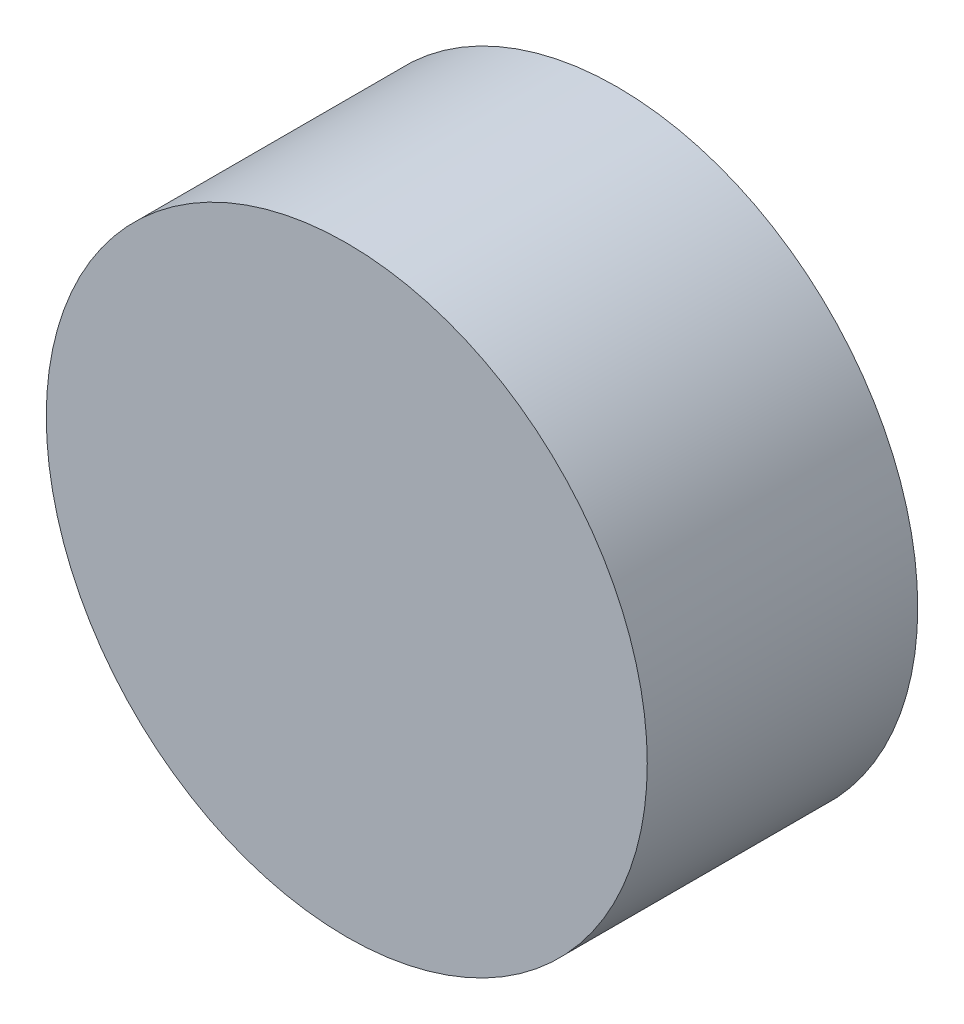
ISO-10303-21;
HEADER;
FILE_DESCRIPTION(('STEP AP214'),'2;1');
FILE_NAME('part.step','',(''),(''),'','','');
FILE_SCHEMA(('AUTOMOTIVE_DESIGN { 1 0 10303 214 1 1 1 1 }'));
ENDSEC;
DATA;
#1=APPLICATION_CONTEXT('core data for automotive mechanical design processes');
#2=APPLICATION_PROTOCOL_DEFINITION('international standard','automotive_design',2000,#1);
#3=PRODUCT_CONTEXT('',#1,'mechanical');
#4=PRODUCT('Part','Part','',(#3));
#5=PRODUCT_RELATED_PRODUCT_CATEGORY('part','',(#4));
#6=PRODUCT_DEFINITION_FORMATION('','',#4);
#7=PRODUCT_DEFINITION_CONTEXT('part definition',#1,'design');
#8=PRODUCT_DEFINITION('design','',#6,#7);
#9=PRODUCT_DEFINITION_SHAPE('','',#8);
#10=(LENGTH_UNIT() NAMED_UNIT(*) SI_UNIT(.MILLI.,.METRE.));
#11=(NAMED_UNIT(*) PLANE_ANGLE_UNIT() SI_UNIT($,.RADIAN.));
#12=(NAMED_UNIT(*) SI_UNIT($,.STERADIAN.) SOLID_ANGLE_UNIT());
#13=UNCERTAINTY_MEASURE_WITH_UNIT(LENGTH_MEASURE(1.E-05),#10,'distance_accuracy_value','');
#14=(GEOMETRIC_REPRESENTATION_CONTEXT(3) GLOBAL_UNCERTAINTY_ASSIGNED_CONTEXT((#13)) GLOBAL_UNIT_ASSIGNED_CONTEXT((#10,
#11,#12)) REPRESENTATION_CONTEXT('',''));
#15=CARTESIAN_POINT('',(0.,0.,0.));
#16=DIRECTION('',(0.,0.,1.));
#17=DIRECTION('',(1.,0.,0.));
#18=AXIS2_PLACEMENT_3D('',#15,#16,#17);
#19=CARTESIAN_POINT('',(-1.90819582357449E-13,-150.082000000014,9.));
#20=DIRECTION('',(0.,0.,-1.));
#21=DIRECTION('',(-1.,0.,0.));
#22=AXIS2_PLACEMENT_3D('',#19,#20,#21);
#23=CYLINDRICAL_SURFACE('',#22,10.0000000000042);
#24=CARTESIAN_POINT('',(-1.90819582357449E-13,-150.082000000014,9.));
#25=DIRECTION('',(0.,0.,1.));
#26=DIRECTION('',(1.,0.,0.));
#27=AXIS2_PLACEMENT_3D('',#24,#25,#26);
#28=CIRCLE('',#27,10.0000000000042);
#29=CARTESIAN_POINT('',(10.000000000004,-150.082000000014,9.));
#30=VERTEX_POINT('',#29);
#31=EDGE_CURVE('E10',#30,#30,#28,.T.);
#32=ORIENTED_EDGE('',*,*,#31,.F.);
#33=EDGE_LOOP('',(#32));
#34=FACE_BOUND('',#33,.T.);
#35=CARTESIAN_POINT('',(-1.90819582357449E-13,-150.082000000014,0.));
#36=DIRECTION('',(0.,0.,1.));
#37=DIRECTION('',(1.,0.,0.));
#38=AXIS2_PLACEMENT_3D('',#35,#36,#37);
#39=CIRCLE('',#38,10.0000000000042);
#40=CARTESIAN_POINT('',(10.000000000004,-150.082000000014,0.));
#41=VERTEX_POINT('',#40);
#42=EDGE_CURVE('E40',#41,#41,#39,.T.);
#43=ORIENTED_EDGE('',*,*,#42,.T.);
#44=EDGE_LOOP('',(#43));
#45=FACE_BOUND('',#44,.T.);
#46=ADVANCED_FACE('F37',(#34,#45),#23,.T.);
#47=CARTESIAN_POINT('',(-1.90819582357449E-13,-150.082000000014,9.));
#48=DIRECTION('',(0.,0.,1.));
#49=DIRECTION('',(1.,0.,0.));
#50=AXIS2_PLACEMENT_3D('',#47,#48,#49);
#51=PLANE('',#50);
#52=ORIENTED_EDGE('',*,*,#31,.T.);
#53=EDGE_LOOP('',(#52));
#54=FACE_BOUND('',#53,.T.);
#55=ADVANCED_FACE('F52',(#54),#51,.T.);
#56=CARTESIAN_POINT('',(-1.90819582357449E-13,-150.082000000014,0.));
#57=DIRECTION('',(0.,0.,1.));
#58=DIRECTION('',(1.,0.,0.));
#59=AXIS2_PLACEMENT_3D('',#56,#57,#58);
#60=PLANE('',#59);
#61=ORIENTED_EDGE('',*,*,#42,.F.);
#62=EDGE_LOOP('',(#61));
#63=FACE_BOUND('',#62,.T.);
#64=ADVANCED_FACE('F50',(#63),#60,.F.);
#65=CLOSED_SHELL('',(#46,#55,#64));
#66=MANIFOLD_SOLID_BREP('B2',#65);
#67=ADVANCED_BREP_SHAPE_REPRESENTATION('',(#18,#66),#14);
#68=SHAPE_DEFINITION_REPRESENTATION(#9,#67);
ENDSEC;
END-ISO-10303-21;
